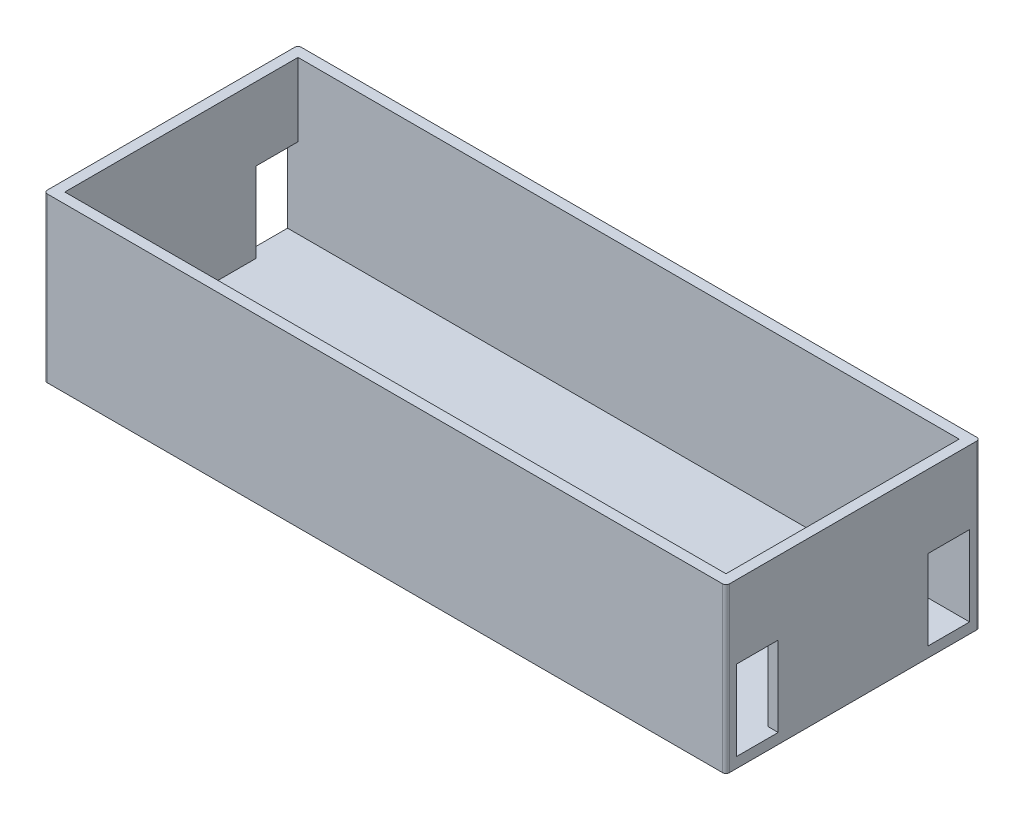
ISO-10303-21;
HEADER;
FILE_DESCRIPTION(('STEP AP214'),'2;1');
FILE_NAME('part.step','',(''),(''),'','','');
FILE_SCHEMA(('AUTOMOTIVE_DESIGN { 1 0 10303 214 1 1 1 1 }'));
ENDSEC;
DATA;
#1=APPLICATION_CONTEXT('core data for automotive mechanical design processes');
#2=APPLICATION_PROTOCOL_DEFINITION('international standard','automotive_design',2000,#1);
#3=PRODUCT_CONTEXT('',#1,'mechanical');
#4=PRODUCT('Part','Part','',(#3));
#5=PRODUCT_RELATED_PRODUCT_CATEGORY('part','',(#4));
#6=PRODUCT_DEFINITION_FORMATION('','',#4);
#7=PRODUCT_DEFINITION_CONTEXT('part definition',#1,'design');
#8=PRODUCT_DEFINITION('design','',#6,#7);
#9=PRODUCT_DEFINITION_SHAPE('','',#8);
#10=(LENGTH_UNIT() NAMED_UNIT(*) SI_UNIT(.MILLI.,.METRE.));
#11=(NAMED_UNIT(*) PLANE_ANGLE_UNIT() SI_UNIT($,.RADIAN.));
#12=(NAMED_UNIT(*) SI_UNIT($,.STERADIAN.) SOLID_ANGLE_UNIT());
#13=UNCERTAINTY_MEASURE_WITH_UNIT(LENGTH_MEASURE(1.E-05),#10,'distance_accuracy_value','');
#14=(GEOMETRIC_REPRESENTATION_CONTEXT(3) GLOBAL_UNCERTAINTY_ASSIGNED_CONTEXT((#13)) GLOBAL_UNIT_ASSIGNED_CONTEXT((#10,
#11,#12)) REPRESENTATION_CONTEXT('',''));
#15=CARTESIAN_POINT('',(0.,0.,0.));
#16=DIRECTION('',(0.,0.,1.));
#17=DIRECTION('',(1.,0.,0.));
#18=AXIS2_PLACEMENT_3D('',#15,#16,#17);
#19=CARTESIAN_POINT('',(0.,3.,0.));
#20=DIRECTION('',(1.,0.,0.));
#21=DIRECTION('',(0.,0.,-1.));
#22=AXIS2_PLACEMENT_3D('',#19,#20,#21);
#23=PLANE('',#22);
#24=DIRECTION('',(0.,0.,1.));
#25=VECTOR('',#24,1.);
#26=CARTESIAN_POINT('',(0.,26.,-3.));
#27=LINE('',#26,#25);
#28=CARTESIAN_POINT('',(0.,26.,-15.));
#29=VERTEX_POINT('',#28);
#30=CARTESIAN_POINT('',(0.,26.,-3.));
#31=VERTEX_POINT('',#30);
#32=EDGE_CURVE('E227',#29,#31,#27,.T.);
#33=ORIENTED_EDGE('',*,*,#32,.T.);
#34=DIRECTION('',(0.,-1.,0.));
#35=VECTOR('',#34,1.);
#36=CARTESIAN_POINT('',(0.,26.,-3.));
#37=LINE('',#36,#35);
#38=CARTESIAN_POINT('',(0.,3.,-3.));
#39=VERTEX_POINT('',#38);
#40=EDGE_CURVE('E207',#31,#39,#37,.T.);
#41=ORIENTED_EDGE('',*,*,#40,.T.);
#42=DIRECTION('',(0.,0.,-1.));
#43=VECTOR('',#42,1.);
#44=CARTESIAN_POINT('',(0.,3.,-3.));
#45=LINE('',#44,#43);
#46=CARTESIAN_POINT('',(0.,3.,-15.));
#47=VERTEX_POINT('',#46);
#48=EDGE_CURVE('E218',#39,#47,#45,.T.);
#49=ORIENTED_EDGE('',*,*,#48,.T.);
#50=DIRECTION('',(0.,1.,0.));
#51=VECTOR('',#50,1.);
#52=CARTESIAN_POINT('',(0.,26.,-15.));
#53=LINE('',#52,#51);
#54=EDGE_CURVE('E55',#47,#29,#53,.T.);
#55=ORIENTED_EDGE('',*,*,#54,.T.);
#56=EDGE_LOOP('',(#33,#41,#49,#55));
#57=FACE_BOUND('',#56,.T.);
#58=DIRECTION('',(0.,0.,1.));
#59=VECTOR('',#58,1.);
#60=CARTESIAN_POINT('',(0.,26.,-58.));
#61=LINE('',#60,#59);
#62=CARTESIAN_POINT('',(0.,26.,-70.));
#63=VERTEX_POINT('',#62);
#64=CARTESIAN_POINT('',(0.,26.,-58.));
#65=VERTEX_POINT('',#64);
#66=EDGE_CURVE('E275',#63,#65,#61,.T.);
#67=ORIENTED_EDGE('',*,*,#66,.T.);
#68=DIRECTION('',(0.,-1.,0.));
#69=VECTOR('',#68,1.);
#70=CARTESIAN_POINT('',(0.,26.,-58.));
#71=LINE('',#70,#69);
#72=CARTESIAN_POINT('',(0.,3.,-58.));
#73=VERTEX_POINT('',#72);
#74=EDGE_CURVE('E262',#65,#73,#71,.T.);
#75=ORIENTED_EDGE('',*,*,#74,.T.);
#76=DIRECTION('',(0.,0.,-1.));
#77=VECTOR('',#76,1.);
#78=CARTESIAN_POINT('',(0.,3.,-58.));
#79=LINE('',#78,#77);
#80=CARTESIAN_POINT('',(0.,2.99999999999999,-70.));
#81=VERTEX_POINT('',#80);
#82=EDGE_CURVE('E266',#73,#81,#79,.T.);
#83=ORIENTED_EDGE('',*,*,#82,.T.);
#84=DIRECTION('',(0.,1.,0.));
#85=VECTOR('',#84,1.);
#86=CARTESIAN_POINT('',(0.,26.,-70.));
#87=LINE('',#86,#85);
#88=EDGE_CURVE('E271',#81,#63,#87,.T.);
#89=ORIENTED_EDGE('',*,*,#88,.T.);
#90=EDGE_LOOP('',(#67,#75,#83,#89));
#91=FACE_BOUND('',#90,.T.);
#92=DIRECTION('',(0.,0.,1.));
#93=VECTOR('',#92,1.);
#94=CARTESIAN_POINT('',(0.,47.,-73.));
#95=LINE('',#94,#93);
#96=CARTESIAN_POINT('',(0.,47.,-72.));
#97=VERTEX_POINT('',#96);
#98=CARTESIAN_POINT('',(0.,47.,-1.));
#99=VERTEX_POINT('',#98);
#100=EDGE_CURVE('E361',#97,#99,#95,.T.);
#101=ORIENTED_EDGE('',*,*,#100,.F.);
#102=DIRECTION('',(0.,-1.,0.));
#103=VECTOR('',#102,1.);
#104=CARTESIAN_POINT('',(0.,3.,-72.));
#105=LINE('',#104,#103);
#106=CARTESIAN_POINT('',(0.,0.,-72.));
#107=VERTEX_POINT('',#106);
#108=EDGE_CURVE('E396',#97,#107,#105,.T.);
#109=ORIENTED_EDGE('',*,*,#108,.T.);
#110=DIRECTION('',(0.,0.,1.));
#111=VECTOR('',#110,1.);
#112=CARTESIAN_POINT('',(0.,0.,0.));
#113=LINE('',#112,#111);
#114=CARTESIAN_POINT('',(0.,0.,-1.));
#115=VERTEX_POINT('',#114);
#116=EDGE_CURVE('E377',#107,#115,#113,.T.);
#117=ORIENTED_EDGE('',*,*,#116,.T.);
#118=DIRECTION('',(0.,-1.,0.));
#119=VECTOR('',#118,1.);
#120=CARTESIAN_POINT('',(0.,3.,-1.));
#121=LINE('',#120,#119);
#122=EDGE_CURVE('E393',#115,#99,#121,.F.);
#123=ORIENTED_EDGE('',*,*,#122,.T.);
#124=EDGE_LOOP('',(#101,#109,#117,#123));
#125=FACE_BOUND('',#124,.T.);
#126=ADVANCED_FACE('F39',(#57,#91,#125),#23,.F.);
#127=CARTESIAN_POINT('',(0.,3.,0.));
#128=DIRECTION('',(0.,0.,-1.));
#129=DIRECTION('',(-1.,0.,0.));
#130=AXIS2_PLACEMENT_3D('',#127,#128,#129);
#131=PLANE('',#130);
#132=DIRECTION('',(1.,0.,0.));
#133=VECTOR('',#132,1.);
#134=CARTESIAN_POINT('',(0.,47.,0.));
#135=LINE('',#134,#133);
#136=CARTESIAN_POINT('',(1.,47.,0.));
#137=VERTEX_POINT('',#136);
#138=CARTESIAN_POINT('',(195.,47.,0.));
#139=VERTEX_POINT('',#138);
#140=EDGE_CURVE('E365',#137,#139,#135,.T.);
#141=ORIENTED_EDGE('',*,*,#140,.F.);
#142=DIRECTION('',(0.,-1.,0.));
#143=VECTOR('',#142,1.);
#144=CARTESIAN_POINT('',(1.,3.,0.));
#145=LINE('',#144,#143);
#146=CARTESIAN_POINT('',(1.,0.,0.));
#147=VERTEX_POINT('',#146);
#148=EDGE_CURVE('E434',#137,#147,#145,.T.);
#149=ORIENTED_EDGE('',*,*,#148,.T.);
#150=DIRECTION('',(1.,0.,0.));
#151=VECTOR('',#150,1.);
#152=CARTESIAN_POINT('',(0.,0.,0.));
#153=LINE('',#152,#151);
#154=CARTESIAN_POINT('',(195.,0.,0.));
#155=VERTEX_POINT('',#154);
#156=EDGE_CURVE('E381',#147,#155,#153,.T.);
#157=ORIENTED_EDGE('',*,*,#156,.T.);
#158=DIRECTION('',(0.,-1.,0.));
#159=VECTOR('',#158,1.);
#160=CARTESIAN_POINT('',(195.,3.,0.));
#161=LINE('',#160,#159);
#162=EDGE_CURVE('E431',#155,#139,#161,.F.);
#163=ORIENTED_EDGE('',*,*,#162,.T.);
#164=EDGE_LOOP('',(#141,#149,#157,#163));
#165=FACE_BOUND('',#164,.T.);
#166=ADVANCED_FACE('F478',(#165),#131,.F.);
#167=CARTESIAN_POINT('',(196.,3.,0.));
#168=DIRECTION('',(-1.,0.,0.));
#169=DIRECTION('',(0.,0.,1.));
#170=AXIS2_PLACEMENT_3D('',#167,#168,#169);
#171=PLANE('',#170);
#172=DIRECTION('',(0.,0.,-1.));
#173=VECTOR('',#172,1.);
#174=CARTESIAN_POINT('',(196.,3.,-3.));
#175=LINE('',#174,#173);
#176=CARTESIAN_POINT('',(196.,3.,-3.));
#177=VERTEX_POINT('',#176);
#178=CARTESIAN_POINT('',(196.,3.,-15.));
#179=VERTEX_POINT('',#178);
#180=EDGE_CURVE('E243',#177,#179,#175,.T.);
#181=ORIENTED_EDGE('',*,*,#180,.F.);
#182=DIRECTION('',(0.,-1.,0.));
#183=VECTOR('',#182,1.);
#184=CARTESIAN_POINT('',(196.,26.,-3.));
#185=LINE('',#184,#183);
#186=CARTESIAN_POINT('',(196.,26.,-3.));
#187=VERTEX_POINT('',#186);
#188=EDGE_CURVE('E210',#187,#177,#185,.T.);
#189=ORIENTED_EDGE('',*,*,#188,.F.);
#190=DIRECTION('',(0.,0.,1.));
#191=VECTOR('',#190,1.);
#192=CARTESIAN_POINT('',(196.,26.,-3.));
#193=LINE('',#192,#191);
#194=CARTESIAN_POINT('',(196.,26.,-15.));
#195=VERTEX_POINT('',#194);
#196=EDGE_CURVE('E229',#195,#187,#193,.T.);
#197=ORIENTED_EDGE('',*,*,#196,.F.);
#198=DIRECTION('',(0.,1.,0.));
#199=VECTOR('',#198,1.);
#200=CARTESIAN_POINT('',(196.,26.,-15.));
#201=LINE('',#200,#199);
#202=EDGE_CURVE('E233',#179,#195,#201,.T.);
#203=ORIENTED_EDGE('',*,*,#202,.F.);
#204=EDGE_LOOP('',(#181,#189,#197,#203));
#205=FACE_BOUND('',#204,.T.);
#206=DIRECTION('',(0.,0.,-1.));
#207=VECTOR('',#206,1.);
#208=CARTESIAN_POINT('',(196.,3.,-58.));
#209=LINE('',#208,#207);
#210=CARTESIAN_POINT('',(196.,3.,-58.));
#211=VERTEX_POINT('',#210);
#212=CARTESIAN_POINT('',(196.,3.,-70.));
#213=VERTEX_POINT('',#212);
#214=EDGE_CURVE('E283',#211,#213,#209,.T.);
#215=ORIENTED_EDGE('',*,*,#214,.F.);
#216=DIRECTION('',(0.,-1.,0.));
#217=VECTOR('',#216,1.);
#218=CARTESIAN_POINT('',(196.,26.,-58.));
#219=LINE('',#218,#217);
#220=CARTESIAN_POINT('',(196.,26.,-58.));
#221=VERTEX_POINT('',#220);
#222=EDGE_CURVE('E280',#221,#211,#219,.T.);
#223=ORIENTED_EDGE('',*,*,#222,.F.);
#224=DIRECTION('',(0.,0.,1.));
#225=VECTOR('',#224,1.);
#226=CARTESIAN_POINT('',(196.,26.,-58.));
#227=LINE('',#226,#225);
#228=CARTESIAN_POINT('',(196.,26.,-70.));
#229=VERTEX_POINT('',#228);
#230=EDGE_CURVE('E267',#229,#221,#227,.T.);
#231=ORIENTED_EDGE('',*,*,#230,.F.);
#232=DIRECTION('',(0.,1.,0.));
#233=VECTOR('',#232,1.);
#234=CARTESIAN_POINT('',(196.,26.,-70.));
#235=LINE('',#234,#233);
#236=EDGE_CURVE('E286',#213,#229,#235,.T.);
#237=ORIENTED_EDGE('',*,*,#236,.F.);
#238=EDGE_LOOP('',(#215,#223,#231,#237));
#239=FACE_BOUND('',#238,.T.);
#240=DIRECTION('',(0.,0.,-1.));
#241=VECTOR('',#240,1.);
#242=CARTESIAN_POINT('',(196.,0.,0.));
#243=LINE('',#242,#241);
#244=CARTESIAN_POINT('',(196.,0.,-1.));
#245=VERTEX_POINT('',#244);
#246=CARTESIAN_POINT('',(196.,0.,-72.));
#247=VERTEX_POINT('',#246);
#248=EDGE_CURVE('E385',#245,#247,#243,.T.);
#249=ORIENTED_EDGE('',*,*,#248,.T.);
#250=DIRECTION('',(0.,-1.,0.));
#251=VECTOR('',#250,1.);
#252=CARTESIAN_POINT('',(196.,3.,-72.));
#253=LINE('',#252,#251);
#254=CARTESIAN_POINT('',(196.,47.,-72.));
#255=VERTEX_POINT('',#254);
#256=EDGE_CURVE('E48',#247,#255,#253,.F.);
#257=ORIENTED_EDGE('',*,*,#256,.T.);
#258=DIRECTION('',(0.,0.,-1.));
#259=VECTOR('',#258,1.);
#260=CARTESIAN_POINT('',(196.,47.,0.));
#261=LINE('',#260,#259);
#262=CARTESIAN_POINT('',(196.,47.,-1.));
#263=VERTEX_POINT('',#262);
#264=EDGE_CURVE('E369',#263,#255,#261,.T.);
#265=ORIENTED_EDGE('',*,*,#264,.F.);
#266=DIRECTION('',(0.,-1.,0.));
#267=VECTOR('',#266,1.);
#268=CARTESIAN_POINT('',(196.,3.,-1.));
#269=LINE('',#268,#267);
#270=EDGE_CURVE('E438',#263,#245,#269,.T.);
#271=ORIENTED_EDGE('',*,*,#270,.T.);
#272=EDGE_LOOP('',(#249,#257,#265,#271));
#273=FACE_BOUND('',#272,.T.);
#274=ADVANCED_FACE('F445',(#205,#239,#273),#171,.F.);
#275=CARTESIAN_POINT('',(0.,3.,-73.));
#276=DIRECTION('',(0.,0.,1.));
#277=DIRECTION('',(1.,0.,0.));
#278=AXIS2_PLACEMENT_3D('',#275,#276,#277);
#279=PLANE('',#278);
#280=DIRECTION('',(-1.,0.,0.));
#281=VECTOR('',#280,1.);
#282=CARTESIAN_POINT('',(0.,0.,-73.));
#283=LINE('',#282,#281);
#284=CARTESIAN_POINT('',(195.,0.,-73.));
#285=VERTEX_POINT('',#284);
#286=CARTESIAN_POINT('',(1.,0.,-73.));
#287=VERTEX_POINT('',#286);
#288=EDGE_CURVE('E389',#285,#287,#283,.T.);
#289=ORIENTED_EDGE('',*,*,#288,.T.);
#290=DIRECTION('',(0.,-1.,0.));
#291=VECTOR('',#290,1.);
#292=CARTESIAN_POINT('',(1.,3.,-73.));
#293=LINE('',#292,#291);
#294=CARTESIAN_POINT('',(1.,47.,-73.));
#295=VERTEX_POINT('',#294);
#296=EDGE_CURVE('E416',#287,#295,#293,.F.);
#297=ORIENTED_EDGE('',*,*,#296,.T.);
#298=DIRECTION('',(-1.,0.,0.));
#299=VECTOR('',#298,1.);
#300=CARTESIAN_POINT('',(196.,47.,-73.));
#301=LINE('',#300,#299);
#302=CARTESIAN_POINT('',(195.,47.,-73.));
#303=VERTEX_POINT('',#302);
#304=EDGE_CURVE('E373',#303,#295,#301,.T.);
#305=ORIENTED_EDGE('',*,*,#304,.F.);
#306=DIRECTION('',(0.,-1.,0.));
#307=VECTOR('',#306,1.);
#308=CARTESIAN_POINT('',(195.,3.,-73.));
#309=LINE('',#308,#307);
#310=EDGE_CURVE('E412',#303,#285,#309,.T.);
#311=ORIENTED_EDGE('',*,*,#310,.T.);
#312=EDGE_LOOP('',(#289,#297,#305,#311));
#313=FACE_BOUND('',#312,.T.);
#314=ADVANCED_FACE('F459',(#313),#279,.F.);
#315=CARTESIAN_POINT('',(0.,0.,0.));
#316=DIRECTION('',(0.,-1.,0.));
#317=DIRECTION('',(0.,0.,-1.));
#318=AXIS2_PLACEMENT_3D('',#315,#316,#317);
#319=PLANE('',#318);
#320=ORIENTED_EDGE('',*,*,#116,.F.);
#321=CARTESIAN_POINT('',(1.,0.,-72.));
#322=DIRECTION('',(0.,-1.,0.));
#323=DIRECTION('',(0.,0.,-1.));
#324=AXIS2_PLACEMENT_3D('',#321,#322,#323);
#325=CIRCLE('',#324,1.);
#326=EDGE_CURVE('E409',#107,#287,#325,.T.);
#327=ORIENTED_EDGE('',*,*,#326,.T.);
#328=ORIENTED_EDGE('',*,*,#288,.F.);
#329=CARTESIAN_POINT('',(195.,0.,-72.));
#330=DIRECTION('',(0.,-1.,0.));
#331=DIRECTION('',(0.,0.,-1.));
#332=AXIS2_PLACEMENT_3D('',#329,#330,#331);
#333=CIRCLE('',#332,1.);
#334=EDGE_CURVE('E403',#285,#247,#333,.T.);
#335=ORIENTED_EDGE('',*,*,#334,.T.);
#336=ORIENTED_EDGE('',*,*,#248,.F.);
#337=CARTESIAN_POINT('',(195.,0.,-1.));
#338=DIRECTION('',(0.,-1.,0.));
#339=DIRECTION('',(0.,0.,-1.));
#340=AXIS2_PLACEMENT_3D('',#337,#338,#339);
#341=CIRCLE('',#340,1.);
#342=EDGE_CURVE('E400',#245,#155,#341,.T.);
#343=ORIENTED_EDGE('',*,*,#342,.T.);
#344=ORIENTED_EDGE('',*,*,#156,.F.);
#345=CARTESIAN_POINT('',(1.,0.,-1.));
#346=DIRECTION('',(0.,-1.,0.));
#347=DIRECTION('',(0.,0.,-1.));
#348=AXIS2_PLACEMENT_3D('',#345,#346,#347);
#349=CIRCLE('',#348,1.);
#350=EDGE_CURVE('E406',#147,#115,#349,.T.);
#351=ORIENTED_EDGE('',*,*,#350,.T.);
#352=EDGE_LOOP('',(#320,#327,#328,#335,#336,#343,#344,#351));
#353=FACE_BOUND('',#352,.T.);
#354=ADVANCED_FACE('F463',(#353),#319,.T.);
#355=CARTESIAN_POINT('',(0.,47.,0.));
#356=DIRECTION('',(0.,1.,0.));
#357=DIRECTION('',(0.,0.,1.));
#358=AXIS2_PLACEMENT_3D('',#355,#356,#357);
#359=PLANE('',#358);
#360=ORIENTED_EDGE('',*,*,#304,.T.);
#361=CARTESIAN_POINT('',(1.,47.,-72.));
#362=DIRECTION('',(0.,1.,0.));
#363=DIRECTION('',(0.,0.,1.));
#364=AXIS2_PLACEMENT_3D('',#361,#362,#363);
#365=CIRCLE('',#364,1.);
#366=EDGE_CURVE('E428',#295,#97,#365,.T.);
#367=ORIENTED_EDGE('',*,*,#366,.T.);
#368=ORIENTED_EDGE('',*,*,#100,.T.);
#369=CARTESIAN_POINT('',(1.,47.,-1.));
#370=DIRECTION('',(0.,1.,0.));
#371=DIRECTION('',(0.,0.,1.));
#372=AXIS2_PLACEMENT_3D('',#369,#370,#371);
#373=CIRCLE('',#372,1.);
#374=EDGE_CURVE('E425',#99,#137,#373,.T.);
#375=ORIENTED_EDGE('',*,*,#374,.T.);
#376=ORIENTED_EDGE('',*,*,#140,.T.);
#377=CARTESIAN_POINT('',(195.,47.,-1.));
#378=DIRECTION('',(0.,1.,0.));
#379=DIRECTION('',(0.,0.,1.));
#380=AXIS2_PLACEMENT_3D('',#377,#378,#379);
#381=CIRCLE('',#380,1.);
#382=EDGE_CURVE('E419',#139,#263,#381,.T.);
#383=ORIENTED_EDGE('',*,*,#382,.T.);
#384=ORIENTED_EDGE('',*,*,#264,.T.);
#385=CARTESIAN_POINT('',(195.,47.,-72.));
#386=DIRECTION('',(0.,1.,0.));
#387=DIRECTION('',(0.,0.,1.));
#388=AXIS2_PLACEMENT_3D('',#385,#386,#387);
#389=CIRCLE('',#388,1.);
#390=EDGE_CURVE('E422',#255,#303,#389,.T.);
#391=ORIENTED_EDGE('',*,*,#390,.T.);
#392=EDGE_LOOP('',(#360,#367,#368,#375,#376,#383,#384,#391));
#393=FACE_BOUND('',#392,.T.);
#394=DIRECTION('',(1.,0.,0.));
#395=VECTOR('',#394,1.);
#396=CARTESIAN_POINT('',(3.00000000000001,47.,-3.));
#397=LINE('',#396,#395);
#398=CARTESIAN_POINT('',(3.00000000000001,47.,-3.));
#399=VERTEX_POINT('',#398);
#400=CARTESIAN_POINT('',(193.,47.,-3.));
#401=VERTEX_POINT('',#400);
#402=EDGE_CURVE('E329',#399,#401,#397,.T.);
#403=ORIENTED_EDGE('',*,*,#402,.F.);
#404=DIRECTION('',(0.,0.,1.));
#405=VECTOR('',#404,1.);
#406=CARTESIAN_POINT('',(3.,47.,-70.));
#407=LINE('',#406,#405);
#408=CARTESIAN_POINT('',(3.,47.,-70.));
#409=VERTEX_POINT('',#408);
#410=EDGE_CURVE('E326',#409,#399,#407,.T.);
#411=ORIENTED_EDGE('',*,*,#410,.F.);
#412=DIRECTION('',(-1.,0.,0.));
#413=VECTOR('',#412,1.);
#414=CARTESIAN_POINT('',(3.,47.,-70.));
#415=LINE('',#414,#413);
#416=CARTESIAN_POINT('',(193.,47.,-70.));
#417=VERTEX_POINT('',#416);
#418=EDGE_CURVE('E336',#417,#409,#415,.T.);
#419=ORIENTED_EDGE('',*,*,#418,.F.);
#420=DIRECTION('',(0.,0.,-1.));
#421=VECTOR('',#420,1.);
#422=CARTESIAN_POINT('',(193.,47.,-70.));
#423=LINE('',#422,#421);
#424=EDGE_CURVE('E332',#401,#417,#423,.T.);
#425=ORIENTED_EDGE('',*,*,#424,.F.);
#426=EDGE_LOOP('',(#403,#411,#419,#425));
#427=FACE_BOUND('',#426,.T.);
#428=ADVANCED_FACE('F451',(#393,#427),#359,.T.);
#429=CARTESIAN_POINT('',(3.,47.,-70.));
#430=DIRECTION('',(1.,0.,0.));
#431=DIRECTION('',(0.,0.,-1.));
#432=AXIS2_PLACEMENT_3D('',#429,#430,#431);
#433=PLANE('',#432);
#434=DIRECTION('',(0.,0.,1.));
#435=VECTOR('',#434,1.);
#436=CARTESIAN_POINT('',(3.,26.,-70.));
#437=LINE('',#436,#435);
#438=CARTESIAN_POINT('',(3.00000000000001,26.,-15.));
#439=VERTEX_POINT('',#438);
#440=CARTESIAN_POINT('',(3.00000000000001,26.,-3.));
#441=VERTEX_POINT('',#440);
#442=EDGE_CURVE('E323',#439,#441,#437,.T.);
#443=ORIENTED_EDGE('',*,*,#442,.F.);
#444=DIRECTION('',(0.,1.,0.));
#445=VECTOR('',#444,1.);
#446=CARTESIAN_POINT('',(3.00000000000001,47.,-15.));
#447=LINE('',#446,#445);
#448=CARTESIAN_POINT('',(3.,3.,-15.));
#449=VERTEX_POINT('',#448);
#450=EDGE_CURVE('E314',#449,#439,#447,.T.);
#451=ORIENTED_EDGE('',*,*,#450,.F.);
#452=DIRECTION('',(0.,0.,1.));
#453=VECTOR('',#452,1.);
#454=CARTESIAN_POINT('',(3.,3.,-70.));
#455=LINE('',#454,#453);
#456=CARTESIAN_POINT('',(3.,3.,-58.));
#457=VERTEX_POINT('',#456);
#458=EDGE_CURVE('E215',#457,#449,#455,.T.);
#459=ORIENTED_EDGE('',*,*,#458,.F.);
#460=DIRECTION('',(0.,-1.,0.));
#461=VECTOR('',#460,1.);
#462=CARTESIAN_POINT('',(3.,47.,-58.));
#463=LINE('',#462,#461);
#464=CARTESIAN_POINT('',(3.,26.,-58.));
#465=VERTEX_POINT('',#464);
#466=EDGE_CURVE('E306',#465,#457,#463,.T.);
#467=ORIENTED_EDGE('',*,*,#466,.F.);
#468=DIRECTION('',(0.,0.,1.));
#469=VECTOR('',#468,1.);
#470=CARTESIAN_POINT('',(3.,26.,-70.));
#471=LINE('',#470,#469);
#472=CARTESIAN_POINT('',(3.,26.,-70.));
#473=VERTEX_POINT('',#472);
#474=EDGE_CURVE('E320',#473,#465,#471,.T.);
#475=ORIENTED_EDGE('',*,*,#474,.F.);
#476=DIRECTION('',(0.,-1.,0.));
#477=VECTOR('',#476,1.);
#478=CARTESIAN_POINT('',(3.,47.,-70.));
#479=LINE('',#478,#477);
#480=EDGE_CURVE('E339',#409,#473,#479,.T.);
#481=ORIENTED_EDGE('',*,*,#480,.F.);
#482=ORIENTED_EDGE('',*,*,#410,.T.);
#483=DIRECTION('',(0.,-1.,0.));
#484=VECTOR('',#483,1.);
#485=CARTESIAN_POINT('',(3.00000000000001,47.,-3.));
#486=LINE('',#485,#484);
#487=EDGE_CURVE('E357',#399,#441,#486,.T.);
#488=ORIENTED_EDGE('',*,*,#487,.T.);
#489=EDGE_LOOP('',(#443,#451,#459,#467,#475,#481,#482,#488));
#490=FACE_BOUND('',#489,.T.);
#491=ADVANCED_FACE('F539',(#490),#433,.T.);
#492=CARTESIAN_POINT('',(3.00000000000001,47.,-3.));
#493=DIRECTION('',(0.,0.,-1.));
#494=DIRECTION('',(-1.,0.,0.));
#495=AXIS2_PLACEMENT_3D('',#492,#493,#494);
#496=PLANE('',#495);
#497=DIRECTION('',(0.,-1.,0.));
#498=VECTOR('',#497,1.);
#499=CARTESIAN_POINT('',(193.,47.,-3.));
#500=LINE('',#499,#498);
#501=CARTESIAN_POINT('',(193.,26.,-3.));
#502=VERTEX_POINT('',#501);
#503=EDGE_CURVE('E354',#401,#502,#500,.T.);
#504=ORIENTED_EDGE('',*,*,#503,.T.);
#505=DIRECTION('',(1.,0.,0.));
#506=VECTOR('',#505,1.);
#507=CARTESIAN_POINT('',(0.,26.,-3.));
#508=LINE('',#507,#506);
#509=EDGE_CURVE('E254',#502,#187,#508,.T.);
#510=ORIENTED_EDGE('',*,*,#509,.T.);
#511=ORIENTED_EDGE('',*,*,#188,.T.);
#512=DIRECTION('',(1.,0.,0.));
#513=VECTOR('',#512,1.);
#514=CARTESIAN_POINT('',(3.00000000000001,3.,-3.));
#515=LINE('',#514,#513);
#516=EDGE_CURVE('E201',#39,#177,#515,.T.);
#517=ORIENTED_EDGE('',*,*,#516,.F.);
#518=ORIENTED_EDGE('',*,*,#40,.F.);
#519=EDGE_CURVE('E250',#31,#441,#508,.T.);
#520=ORIENTED_EDGE('',*,*,#519,.T.);
#521=ORIENTED_EDGE('',*,*,#487,.F.);
#522=ORIENTED_EDGE('',*,*,#402,.T.);
#523=EDGE_LOOP('',(#504,#510,#511,#517,#518,#520,#521,#522));
#524=FACE_BOUND('',#523,.T.);
#525=ADVANCED_FACE('F204',(#524),#496,.T.);
#526=CARTESIAN_POINT('',(193.,47.,-70.));
#527=DIRECTION('',(-1.,0.,0.));
#528=DIRECTION('',(0.,0.,1.));
#529=AXIS2_PLACEMENT_3D('',#526,#527,#528);
#530=PLANE('',#529);
#531=DIRECTION('',(0.,0.,-1.));
#532=VECTOR('',#531,1.);
#533=CARTESIAN_POINT('',(193.,26.,-70.));
#534=LINE('',#533,#532);
#535=CARTESIAN_POINT('',(193.,26.,-15.));
#536=VERTEX_POINT('',#535);
#537=EDGE_CURVE('E11',#502,#536,#534,.T.);
#538=ORIENTED_EDGE('',*,*,#537,.F.);
#539=ORIENTED_EDGE('',*,*,#503,.F.);
#540=ORIENTED_EDGE('',*,*,#424,.T.);
#541=DIRECTION('',(0.,-1.,0.));
#542=VECTOR('',#541,1.);
#543=CARTESIAN_POINT('',(193.,47.,-70.));
#544=LINE('',#543,#542);
#545=CARTESIAN_POINT('',(193.,26.,-70.));
#546=VERTEX_POINT('',#545);
#547=EDGE_CURVE('E350',#417,#546,#544,.T.);
#548=ORIENTED_EDGE('',*,*,#547,.T.);
#549=DIRECTION('',(0.,0.,-1.));
#550=VECTOR('',#549,1.);
#551=CARTESIAN_POINT('',(193.,26.,-70.));
#552=LINE('',#551,#550);
#553=CARTESIAN_POINT('',(193.,26.,-58.));
#554=VERTEX_POINT('',#553);
#555=EDGE_CURVE('E317',#554,#546,#552,.T.);
#556=ORIENTED_EDGE('',*,*,#555,.F.);
#557=DIRECTION('',(0.,1.,0.));
#558=VECTOR('',#557,1.);
#559=CARTESIAN_POINT('',(193.,47.,-58.));
#560=LINE('',#559,#558);
#561=CARTESIAN_POINT('',(193.,3.,-58.));
#562=VERTEX_POINT('',#561);
#563=EDGE_CURVE('E253',#562,#554,#560,.T.);
#564=ORIENTED_EDGE('',*,*,#563,.F.);
#565=DIRECTION('',(0.,0.,-1.));
#566=VECTOR('',#565,1.);
#567=CARTESIAN_POINT('',(193.,3.,-70.));
#568=LINE('',#567,#566);
#569=CARTESIAN_POINT('',(193.,3.,-15.));
#570=VERTEX_POINT('',#569);
#571=EDGE_CURVE('E214',#570,#562,#568,.T.);
#572=ORIENTED_EDGE('',*,*,#571,.F.);
#573=DIRECTION('',(0.,-1.,0.));
#574=VECTOR('',#573,1.);
#575=CARTESIAN_POINT('',(193.,47.,-15.));
#576=LINE('',#575,#574);
#577=EDGE_CURVE('E310',#536,#570,#576,.T.);
#578=ORIENTED_EDGE('',*,*,#577,.F.);
#579=EDGE_LOOP('',(#538,#539,#540,#548,#556,#564,#572,#578));
#580=FACE_BOUND('',#579,.T.);
#581=ADVANCED_FACE('F555',(#580),#530,.T.);
#582=CARTESIAN_POINT('',(3.,47.,-70.));
#583=DIRECTION('',(0.,0.,1.));
#584=DIRECTION('',(1.,0.,0.));
#585=AXIS2_PLACEMENT_3D('',#582,#583,#584);
#586=PLANE('',#585);
#587=ORIENTED_EDGE('',*,*,#480,.T.);
#588=DIRECTION('',(1.,0.,0.));
#589=VECTOR('',#588,1.);
#590=CARTESIAN_POINT('',(0.,26.,-70.));
#591=LINE('',#590,#589);
#592=EDGE_CURVE('E297',#63,#473,#591,.T.);
#593=ORIENTED_EDGE('',*,*,#592,.F.);
#594=ORIENTED_EDGE('',*,*,#88,.F.);
#595=DIRECTION('',(-1.,0.,0.));
#596=VECTOR('',#595,1.);
#597=CARTESIAN_POINT('',(3.,3.,-70.));
#598=LINE('',#597,#596);
#599=EDGE_CURVE('E63',#213,#81,#598,.T.);
#600=ORIENTED_EDGE('',*,*,#599,.F.);
#601=ORIENTED_EDGE('',*,*,#236,.T.);
#602=EDGE_CURVE('E300',#546,#229,#591,.T.);
#603=ORIENTED_EDGE('',*,*,#602,.F.);
#604=ORIENTED_EDGE('',*,*,#547,.F.);
#605=ORIENTED_EDGE('',*,*,#418,.T.);
#606=EDGE_LOOP('',(#587,#593,#594,#600,#601,#603,#604,#605));
#607=FACE_BOUND('',#606,.T.);
#608=ADVANCED_FACE('F565',(#607),#586,.T.);
#609=CARTESIAN_POINT('',(0.,3.,0.));
#610=DIRECTION('',(0.,-1.,0.));
#611=DIRECTION('',(0.,0.,-1.));
#612=AXIS2_PLACEMENT_3D('',#609,#610,#611);
#613=PLANE('',#612);
#614=ORIENTED_EDGE('',*,*,#458,.T.);
#615=DIRECTION('',(1.,0.,0.));
#616=VECTOR('',#615,1.);
#617=CARTESIAN_POINT('',(0.,3.,-15.));
#618=LINE('',#617,#616);
#619=EDGE_CURVE('E221',#47,#449,#618,.T.);
#620=ORIENTED_EDGE('',*,*,#619,.F.);
#621=ORIENTED_EDGE('',*,*,#48,.F.);
#622=ORIENTED_EDGE('',*,*,#516,.T.);
#623=ORIENTED_EDGE('',*,*,#180,.T.);
#624=EDGE_CURVE('E240',#570,#179,#618,.T.);
#625=ORIENTED_EDGE('',*,*,#624,.F.);
#626=ORIENTED_EDGE('',*,*,#571,.T.);
#627=DIRECTION('',(1.,0.,0.));
#628=VECTOR('',#627,1.);
#629=CARTESIAN_POINT('',(0.,3.,-58.));
#630=LINE('',#629,#628);
#631=EDGE_CURVE('E279',#562,#211,#630,.T.);
#632=ORIENTED_EDGE('',*,*,#631,.T.);
#633=ORIENTED_EDGE('',*,*,#214,.T.);
#634=ORIENTED_EDGE('',*,*,#599,.T.);
#635=ORIENTED_EDGE('',*,*,#82,.F.);
#636=EDGE_CURVE('E301',#73,#457,#630,.T.);
#637=ORIENTED_EDGE('',*,*,#636,.T.);
#638=EDGE_LOOP('',(#614,#620,#621,#622,#623,#625,#626,#632,#633,#634,#635,#637));
#639=FACE_BOUND('',#638,.T.);
#640=ADVANCED_FACE('F220',(#639),#613,.F.);
#641=CARTESIAN_POINT('',(1.,3.,-72.));
#642=DIRECTION('',(0.,-1.,0.));
#643=DIRECTION('',(0.,0.,-1.));
#644=AXIS2_PLACEMENT_3D('',#641,#642,#643);
#645=CYLINDRICAL_SURFACE('',#644,1.);
#646=ORIENTED_EDGE('',*,*,#366,.F.);
#647=ORIENTED_EDGE('',*,*,#296,.F.);
#648=ORIENTED_EDGE('',*,*,#326,.F.);
#649=ORIENTED_EDGE('',*,*,#108,.F.);
#650=EDGE_LOOP('',(#646,#647,#648,#649));
#651=FACE_BOUND('',#650,.T.);
#652=ADVANCED_FACE('F467',(#651),#645,.T.);
#653=CARTESIAN_POINT('',(1.,3.,-1.));
#654=DIRECTION('',(0.,-1.,0.));
#655=DIRECTION('',(0.,0.,-1.));
#656=AXIS2_PLACEMENT_3D('',#653,#654,#655);
#657=CYLINDRICAL_SURFACE('',#656,1.);
#658=ORIENTED_EDGE('',*,*,#374,.F.);
#659=ORIENTED_EDGE('',*,*,#122,.F.);
#660=ORIENTED_EDGE('',*,*,#350,.F.);
#661=ORIENTED_EDGE('',*,*,#148,.F.);
#662=EDGE_LOOP('',(#658,#659,#660,#661));
#663=FACE_BOUND('',#662,.T.);
#664=ADVANCED_FACE('F475',(#663),#657,.T.);
#665=CARTESIAN_POINT('',(195.,3.,-72.));
#666=DIRECTION('',(0.,-1.,0.));
#667=DIRECTION('',(0.,0.,-1.));
#668=AXIS2_PLACEMENT_3D('',#665,#666,#667);
#669=CYLINDRICAL_SURFACE('',#668,1.);
#670=ORIENTED_EDGE('',*,*,#390,.F.);
#671=ORIENTED_EDGE('',*,*,#256,.F.);
#672=ORIENTED_EDGE('',*,*,#334,.F.);
#673=ORIENTED_EDGE('',*,*,#310,.F.);
#674=EDGE_LOOP('',(#670,#671,#672,#673));
#675=FACE_BOUND('',#674,.T.);
#676=ADVANCED_FACE('F456',(#675),#669,.T.);
#677=CARTESIAN_POINT('',(195.,3.,-1.));
#678=DIRECTION('',(0.,-1.,0.));
#679=DIRECTION('',(0.,0.,-1.));
#680=AXIS2_PLACEMENT_3D('',#677,#678,#679);
#681=CYLINDRICAL_SURFACE('',#680,1.);
#682=ORIENTED_EDGE('',*,*,#382,.F.);
#683=ORIENTED_EDGE('',*,*,#162,.F.);
#684=ORIENTED_EDGE('',*,*,#342,.F.);
#685=ORIENTED_EDGE('',*,*,#270,.F.);
#686=EDGE_LOOP('',(#682,#683,#684,#685));
#687=FACE_BOUND('',#686,.T.);
#688=ADVANCED_FACE('F41',(#687),#681,.T.);
#689=CARTESIAN_POINT('',(0.,26.,-58.));
#690=DIRECTION('',(0.,1.,0.));
#691=DIRECTION('',(0.,0.,1.));
#692=AXIS2_PLACEMENT_3D('',#689,#690,#691);
#693=PLANE('',#692);
#694=ORIENTED_EDGE('',*,*,#555,.T.);
#695=ORIENTED_EDGE('',*,*,#602,.T.);
#696=ORIENTED_EDGE('',*,*,#230,.T.);
#697=DIRECTION('',(1.,0.,0.));
#698=VECTOR('',#697,1.);
#699=CARTESIAN_POINT('',(0.,26.,-58.));
#700=LINE('',#699,#698);
#701=EDGE_CURVE('E296',#554,#221,#700,.T.);
#702=ORIENTED_EDGE('',*,*,#701,.F.);
#703=EDGE_LOOP('',(#694,#695,#696,#702));
#704=FACE_BOUND('',#703,.T.);
#705=ADVANCED_FACE('F482',(#704),#693,.F.);
#706=CARTESIAN_POINT('',(0.,26.,-58.));
#707=DIRECTION('',(0.,0.,1.));
#708=DIRECTION('',(1.,0.,0.));
#709=AXIS2_PLACEMENT_3D('',#706,#707,#708);
#710=PLANE('',#709);
#711=ORIENTED_EDGE('',*,*,#563,.T.);
#712=ORIENTED_EDGE('',*,*,#701,.T.);
#713=ORIENTED_EDGE('',*,*,#222,.T.);
#714=ORIENTED_EDGE('',*,*,#631,.F.);
#715=EDGE_LOOP('',(#711,#712,#713,#714));
#716=FACE_BOUND('',#715,.T.);
#717=ADVANCED_FACE('F487',(#716),#710,.F.);
#718=CARTESIAN_POINT('',(0.,26.,-15.));
#719=DIRECTION('',(0.,0.,-1.));
#720=DIRECTION('',(0.,1.,0.));
#721=AXIS2_PLACEMENT_3D('',#718,#719,#720);
#722=PLANE('',#721);
#723=ORIENTED_EDGE('',*,*,#577,.T.);
#724=ORIENTED_EDGE('',*,*,#624,.T.);
#725=ORIENTED_EDGE('',*,*,#202,.T.);
#726=DIRECTION('',(1.,0.,0.));
#727=VECTOR('',#726,1.);
#728=CARTESIAN_POINT('',(0.,26.,-15.));
#729=LINE('',#728,#727);
#730=EDGE_CURVE('E259',#536,#195,#729,.T.);
#731=ORIENTED_EDGE('',*,*,#730,.F.);
#732=EDGE_LOOP('',(#723,#724,#725,#731));
#733=FACE_BOUND('',#732,.T.);
#734=ADVANCED_FACE('F598',(#733),#722,.F.);
#735=CARTESIAN_POINT('',(0.,26.,-3.));
#736=DIRECTION('',(0.,1.,0.));
#737=DIRECTION('',(0.,0.,1.));
#738=AXIS2_PLACEMENT_3D('',#735,#736,#737);
#739=PLANE('',#738);
#740=ORIENTED_EDGE('',*,*,#537,.T.);
#741=ORIENTED_EDGE('',*,*,#730,.T.);
#742=ORIENTED_EDGE('',*,*,#196,.T.);
#743=ORIENTED_EDGE('',*,*,#509,.F.);
#744=EDGE_LOOP('',(#740,#741,#742,#743));
#745=FACE_BOUND('',#744,.T.);
#746=ADVANCED_FACE('F609',(#745),#739,.F.);
#747=ORIENTED_EDGE('',*,*,#474,.T.);
#748=EDGE_CURVE('E244',#65,#465,#700,.T.);
#749=ORIENTED_EDGE('',*,*,#748,.F.);
#750=ORIENTED_EDGE('',*,*,#66,.F.);
#751=ORIENTED_EDGE('',*,*,#592,.T.);
#752=EDGE_LOOP('',(#747,#749,#750,#751));
#753=FACE_BOUND('',#752,.T.);
#754=ADVANCED_FACE('F490',(#753),#693,.F.);
#755=ORIENTED_EDGE('',*,*,#466,.T.);
#756=ORIENTED_EDGE('',*,*,#636,.F.);
#757=ORIENTED_EDGE('',*,*,#74,.F.);
#758=ORIENTED_EDGE('',*,*,#748,.T.);
#759=EDGE_LOOP('',(#755,#756,#757,#758));
#760=FACE_BOUND('',#759,.T.);
#761=ADVANCED_FACE('F601',(#760),#710,.F.);
#762=ORIENTED_EDGE('',*,*,#442,.T.);
#763=ORIENTED_EDGE('',*,*,#519,.F.);
#764=ORIENTED_EDGE('',*,*,#32,.F.);
#765=EDGE_CURVE('E255',#29,#439,#729,.T.);
#766=ORIENTED_EDGE('',*,*,#765,.T.);
#767=EDGE_LOOP('',(#762,#763,#764,#766));
#768=FACE_BOUND('',#767,.T.);
#769=ADVANCED_FACE('F622',(#768),#739,.F.);
#770=ORIENTED_EDGE('',*,*,#450,.T.);
#771=ORIENTED_EDGE('',*,*,#765,.F.);
#772=ORIENTED_EDGE('',*,*,#54,.F.);
#773=ORIENTED_EDGE('',*,*,#619,.T.);
#774=EDGE_LOOP('',(#770,#771,#772,#773));
#775=FACE_BOUND('',#774,.T.);
#776=ADVANCED_FACE('F612',(#775),#722,.F.);
#777=CLOSED_SHELL('',(#126,#166,#274,#314,#354,#428,#491,#525,#581,#608,#640,#652,#664,#676,
#688,#705,#717,#734,#746,#754,#761,#769,#776));
#778=MANIFOLD_SOLID_BREP('B2',#777);
#779=ADVANCED_BREP_SHAPE_REPRESENTATION('',(#18,#778),#14);
#780=SHAPE_DEFINITION_REPRESENTATION(#9,#779);
ENDSEC;
END-ISO-10303-21;
